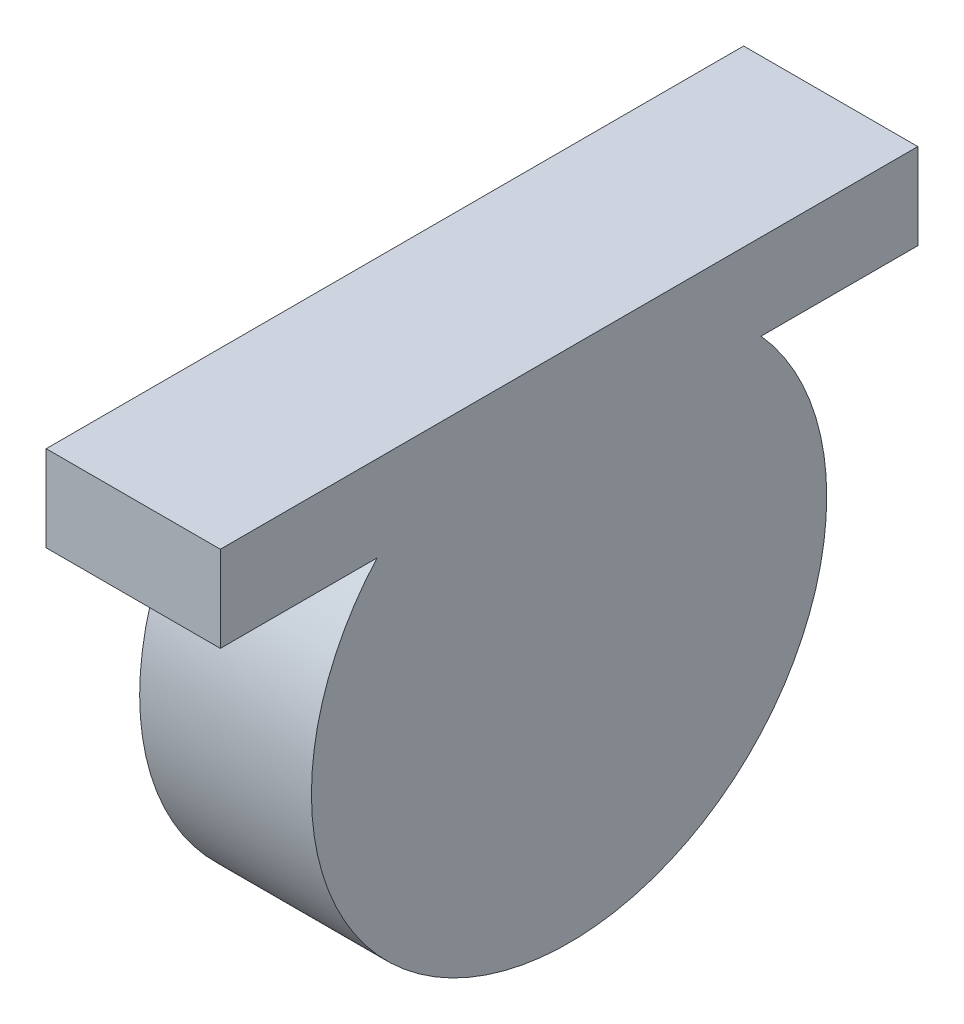
ISO-10303-21;
HEADER;
FILE_DESCRIPTION(('STEP AP214'),'2;1');
FILE_NAME('part.step','',(''),(''),'','','');
FILE_SCHEMA(('AUTOMOTIVE_DESIGN { 1 0 10303 214 1 1 1 1 }'));
ENDSEC;
DATA;
#1=APPLICATION_CONTEXT('core data for automotive mechanical design processes');
#2=APPLICATION_PROTOCOL_DEFINITION('international standard','automotive_design',2000,#1);
#3=PRODUCT_CONTEXT('',#1,'mechanical');
#4=PRODUCT('Part','Part','',(#3));
#5=PRODUCT_RELATED_PRODUCT_CATEGORY('part','',(#4));
#6=PRODUCT_DEFINITION_FORMATION('','',#4);
#7=PRODUCT_DEFINITION_CONTEXT('part definition',#1,'design');
#8=PRODUCT_DEFINITION('design','',#6,#7);
#9=PRODUCT_DEFINITION_SHAPE('','',#8);
#10=(LENGTH_UNIT() NAMED_UNIT(*) SI_UNIT(.MILLI.,.METRE.));
#11=(NAMED_UNIT(*) PLANE_ANGLE_UNIT() SI_UNIT($,.RADIAN.));
#12=(NAMED_UNIT(*) SI_UNIT($,.STERADIAN.) SOLID_ANGLE_UNIT());
#13=UNCERTAINTY_MEASURE_WITH_UNIT(LENGTH_MEASURE(1.E-05),#10,'distance_accuracy_value','');
#14=(GEOMETRIC_REPRESENTATION_CONTEXT(3) GLOBAL_UNCERTAINTY_ASSIGNED_CONTEXT((#13)) GLOBAL_UNIT_ASSIGNED_CONTEXT((#10,
#11,#12)) REPRESENTATION_CONTEXT('',''));
#15=CARTESIAN_POINT('',(0.,0.,0.));
#16=DIRECTION('',(0.,0.,1.));
#17=DIRECTION('',(1.,0.,0.));
#18=AXIS2_PLACEMENT_3D('',#15,#16,#17);
#19=CARTESIAN_POINT('',(524.151448501643,704.936591225599,712.116595063659));
#20=DIRECTION('',(-1.,0.,0.));
#21=DIRECTION('',(0.,0.,0.999999999999998));
#22=AXIS2_PLACEMENT_3D('',#19,#20,#21);
#23=PLANE('',#22);
#24=DIRECTION('',(0.,0.,0.999999999999998));
#25=VECTOR('',#24,1.);
#26=CARTESIAN_POINT('',(524.151448501643,717.636591225599,712.116595063659));
#27=LINE('',#26,#25);
#28=CARTESIAN_POINT('',(524.151448501643,717.636591225601,608.979235793006));
#29=VERTEX_POINT('',#28);
#30=CARTESIAN_POINT('',(524.151448501643,717.636591225599,712.116595063659));
#31=VERTEX_POINT('',#30);
#32=EDGE_CURVE('E100',#29,#31,#27,.T.);
#33=ORIENTED_EDGE('',*,*,#32,.T.);
#34=DIRECTION('',(0.,0.999999999999998,0.));
#35=VECTOR('',#34,1.);
#36=CARTESIAN_POINT('',(524.151448501643,704.936591225599,712.116595063659));
#37=LINE('',#36,#35);
#38=CARTESIAN_POINT('',(524.151448501643,704.936591225599,712.116595063659));
#39=VERTEX_POINT('',#38);
#40=EDGE_CURVE('E11',#39,#31,#37,.T.);
#41=ORIENTED_EDGE('',*,*,#40,.F.);
#42=DIRECTION('',(0.,0.,0.999999999999998));
#43=VECTOR('',#42,1.);
#44=CARTESIAN_POINT('',(524.151448501643,704.936591225599,712.116595063659));
#45=LINE('',#44,#43);
#46=CARTESIAN_POINT('',(524.151448501643,704.936591225596,688.94597874258));
#47=VERTEX_POINT('',#46);
#48=EDGE_CURVE('E87',#47,#39,#45,.T.);
#49=ORIENTED_EDGE('',*,*,#48,.F.);
#50=CARTESIAN_POINT('',(524.151448501643,679.536591225597,660.547915428331));
#51=DIRECTION('',(1.,0.,0.));
#52=DIRECTION('',(0.,0.,-0.999999999999998));
#53=AXIS2_PLACEMENT_3D('',#50,#51,#52);
#54=CIRCLE('',#53,38.1000000000001);
#55=CARTESIAN_POINT('',(524.151448501643,704.936591225598,632.149852114085));
#56=VERTEX_POINT('',#55);
#57=EDGE_CURVE('E90',#47,#56,#54,.T.);
#58=ORIENTED_EDGE('',*,*,#57,.T.);
#59=CARTESIAN_POINT('',(524.151448501643,704.936591225601,608.979235793006));
#60=VERTEX_POINT('',#59);
#61=EDGE_CURVE('E92',#60,#56,#45,.T.);
#62=ORIENTED_EDGE('',*,*,#61,.F.);
#63=DIRECTION('',(0.,0.999999999999998,0.));
#64=VECTOR('',#63,1.);
#65=CARTESIAN_POINT('',(524.151448501643,704.936591225601,608.979235793006));
#66=LINE('',#65,#64);
#67=EDGE_CURVE('E115',#60,#29,#66,.T.);
#68=ORIENTED_EDGE('',*,*,#67,.T.);
#69=EDGE_LOOP('',(#33,#41,#49,#58,#62,#68));
#70=FACE_BOUND('',#69,.T.);
#71=ADVANCED_FACE('F36',(#70),#23,.F.);
#72=CARTESIAN_POINT('',(524.151448501643,704.936591225599,712.116595063659));
#73=DIRECTION('',(0.,0.,-0.999999999999998));
#74=DIRECTION('',(0.,0.999999999999998,0.));
#75=AXIS2_PLACEMENT_3D('',#72,#73,#74);
#76=PLANE('',#75);
#77=DIRECTION('',(-1.,0.,0.));
#78=VECTOR('',#77,1.);
#79=CARTESIAN_POINT('',(524.151448501643,717.636591225599,712.116595063659));
#80=LINE('',#79,#78);
#81=CARTESIAN_POINT('',(498.398398097907,717.636591225599,712.116595063659));
#82=VERTEX_POINT('',#81);
#83=EDGE_CURVE('E117',#31,#82,#80,.T.);
#84=ORIENTED_EDGE('',*,*,#83,.T.);
#85=DIRECTION('',(0.,0.999999999999998,0.));
#86=VECTOR('',#85,1.);
#87=CARTESIAN_POINT('',(498.398398097907,704.936591225599,712.116595063659));
#88=LINE('',#87,#86);
#89=CARTESIAN_POINT('',(498.398398097907,704.936591225599,712.116595063659));
#90=VERTEX_POINT('',#89);
#91=EDGE_CURVE('E43',#90,#82,#88,.T.);
#92=ORIENTED_EDGE('',*,*,#91,.F.);
#93=DIRECTION('',(-1.,0.,0.));
#94=VECTOR('',#93,1.);
#95=CARTESIAN_POINT('',(524.151448501643,704.936591225599,712.116595063659));
#96=LINE('',#95,#94);
#97=EDGE_CURVE('E109',#39,#90,#96,.T.);
#98=ORIENTED_EDGE('',*,*,#97,.F.);
#99=ORIENTED_EDGE('',*,*,#40,.T.);
#100=EDGE_LOOP('',(#84,#92,#98,#99));
#101=FACE_BOUND('',#100,.T.);
#102=ADVANCED_FACE('F143',(#101),#76,.F.);
#103=CARTESIAN_POINT('',(498.398398097907,704.936591225599,712.116595063659));
#104=DIRECTION('',(1.,0.,0.));
#105=DIRECTION('',(0.,0.,-0.999999999999998));
#106=AXIS2_PLACEMENT_3D('',#103,#104,#105);
#107=PLANE('',#106);
#108=DIRECTION('',(0.,0.,-0.999999999999998));
#109=VECTOR('',#108,1.);
#110=CARTESIAN_POINT('',(498.398398097907,717.636591225599,712.116595063659));
#111=LINE('',#110,#109);
#112=CARTESIAN_POINT('',(498.398398097907,717.636591225601,608.979235793006));
#113=VERTEX_POINT('',#112);
#114=EDGE_CURVE('E119',#82,#113,#111,.T.);
#115=ORIENTED_EDGE('',*,*,#114,.T.);
#116=DIRECTION('',(0.,0.999999999999998,0.));
#117=VECTOR('',#116,1.);
#118=CARTESIAN_POINT('',(498.398398097907,704.936591225601,608.979235793006));
#119=LINE('',#118,#117);
#120=CARTESIAN_POINT('',(498.398398097907,704.936591225601,608.979235793006));
#121=VERTEX_POINT('',#120);
#122=EDGE_CURVE('E124',#121,#113,#119,.T.);
#123=ORIENTED_EDGE('',*,*,#122,.F.);
#124=DIRECTION('',(0.,0.,-0.999999999999998));
#125=VECTOR('',#124,1.);
#126=CARTESIAN_POINT('',(498.398398097907,704.936591225599,712.116595063659));
#127=LINE('',#126,#125);
#128=EDGE_CURVE('E111',#90,#121,#127,.T.);
#129=ORIENTED_EDGE('',*,*,#128,.F.);
#130=ORIENTED_EDGE('',*,*,#91,.T.);
#131=EDGE_LOOP('',(#115,#123,#129,#130));
#132=FACE_BOUND('',#131,.T.);
#133=ADVANCED_FACE('F131',(#132),#107,.F.);
#134=CARTESIAN_POINT('',(524.151448501643,704.936591225601,608.979235793006));
#135=DIRECTION('',(0.,0.,0.999999999999998));
#136=DIRECTION('',(0.,-0.999999999999998,0.));
#137=AXIS2_PLACEMENT_3D('',#134,#135,#136);
#138=PLANE('',#137);
#139=DIRECTION('',(1.,0.,0.));
#140=VECTOR('',#139,1.);
#141=CARTESIAN_POINT('',(524.151448501643,717.636591225601,608.979235793006));
#142=LINE('',#141,#140);
#143=EDGE_CURVE('E93',#113,#29,#142,.T.);
#144=ORIENTED_EDGE('',*,*,#143,.T.);
#145=ORIENTED_EDGE('',*,*,#67,.F.);
#146=DIRECTION('',(1.,0.,0.));
#147=VECTOR('',#146,1.);
#148=CARTESIAN_POINT('',(524.151448501643,704.936591225601,608.979235793006));
#149=LINE('',#148,#147);
#150=EDGE_CURVE('E113',#121,#60,#149,.T.);
#151=ORIENTED_EDGE('',*,*,#150,.F.);
#152=ORIENTED_EDGE('',*,*,#122,.T.);
#153=EDGE_LOOP('',(#144,#145,#151,#152));
#154=FACE_BOUND('',#153,.T.);
#155=ADVANCED_FACE('F141',(#154),#138,.F.);
#156=CARTESIAN_POINT('',(0.,704.936591225595,-1.77635683940025E-12));
#157=DIRECTION('',(0.,0.999999999999998,0.));
#158=DIRECTION('',(0.,0.,0.999999999999998));
#159=AXIS2_PLACEMENT_3D('',#156,#157,#158);
#160=PLANE('',#159);
#161=DIRECTION('',(0.,0.,-0.999999999999998));
#162=VECTOR('',#161,1.);
#163=CARTESIAN_POINT('',(498.751448501642,704.936591225595,-1.77635683940025E-12));
#164=LINE('',#163,#162);
#165=CARTESIAN_POINT('',(498.751448501642,704.936591225596,688.94597874258));
#166=VERTEX_POINT('',#165);
#167=CARTESIAN_POINT('',(498.751448501642,704.936591225598,632.149852114085));
#168=VERTEX_POINT('',#167);
#169=EDGE_CURVE('E54',#166,#168,#164,.T.);
#170=ORIENTED_EDGE('',*,*,#169,.F.);
#171=DIRECTION('',(1.,0.,0.));
#172=VECTOR('',#171,1.);
#173=CARTESIAN_POINT('',(498.751448501642,704.936591225596,688.94597874258));
#174=LINE('',#173,#172);
#175=EDGE_CURVE('E95',#166,#47,#174,.T.);
#176=ORIENTED_EDGE('',*,*,#175,.T.);
#177=ORIENTED_EDGE('',*,*,#48,.T.);
#178=ORIENTED_EDGE('',*,*,#97,.T.);
#179=ORIENTED_EDGE('',*,*,#128,.T.);
#180=ORIENTED_EDGE('',*,*,#150,.T.);
#181=ORIENTED_EDGE('',*,*,#61,.T.);
#182=DIRECTION('',(1.,0.,0.));
#183=VECTOR('',#182,1.);
#184=CARTESIAN_POINT('',(498.751448501642,704.936591225598,632.149852114085));
#185=LINE('',#184,#183);
#186=EDGE_CURVE('E50',#56,#168,#185,.F.);
#187=ORIENTED_EDGE('',*,*,#186,.T.);
#188=EDGE_LOOP('',(#170,#176,#177,#178,#179,#180,#181,#187));
#189=FACE_BOUND('',#188,.T.);
#190=ADVANCED_FACE('F96',(#189),#160,.F.);
#191=CARTESIAN_POINT('',(0.,717.636591225595,-1.77635683940025E-12));
#192=DIRECTION('',(0.,0.999999999999998,0.));
#193=DIRECTION('',(0.,0.,0.999999999999998));
#194=AXIS2_PLACEMENT_3D('',#191,#192,#193);
#195=PLANE('',#194);
#196=ORIENTED_EDGE('',*,*,#83,.F.);
#197=ORIENTED_EDGE('',*,*,#32,.F.);
#198=ORIENTED_EDGE('',*,*,#143,.F.);
#199=ORIENTED_EDGE('',*,*,#114,.F.);
#200=EDGE_LOOP('',(#196,#197,#198,#199));
#201=FACE_BOUND('',#200,.T.);
#202=ADVANCED_FACE('F137',(#201),#195,.T.);
#203=CARTESIAN_POINT('',(498.751448501642,679.536591225597,660.547915428331));
#204=DIRECTION('',(1.,0.,0.));
#205=DIRECTION('',(0.,0.,-0.999999999999998));
#206=AXIS2_PLACEMENT_3D('',#203,#204,#205);
#207=CYLINDRICAL_SURFACE('',#206,38.1000000000001);
#208=ORIENTED_EDGE('',*,*,#175,.F.);
#209=CARTESIAN_POINT('',(498.751448501642,679.536591225597,660.547915428331));
#210=DIRECTION('',(1.,0.,0.));
#211=DIRECTION('',(0.,0.,-0.999999999999998));
#212=AXIS2_PLACEMENT_3D('',#209,#210,#211);
#213=CIRCLE('',#212,38.1000000000001);
#214=EDGE_CURVE('E103',#166,#168,#213,.T.);
#215=ORIENTED_EDGE('',*,*,#214,.T.);
#216=ORIENTED_EDGE('',*,*,#186,.F.);
#217=ORIENTED_EDGE('',*,*,#57,.F.);
#218=EDGE_LOOP('',(#208,#215,#216,#217));
#219=FACE_BOUND('',#218,.T.);
#220=ADVANCED_FACE('F102',(#219),#207,.T.);
#221=CARTESIAN_POINT('',(498.751448501642,679.536591225597,660.547915428331));
#222=DIRECTION('',(1.,0.,0.));
#223=DIRECTION('',(0.,0.,-0.999999999999998));
#224=AXIS2_PLACEMENT_3D('',#221,#222,#223);
#225=PLANE('',#224);
#226=ORIENTED_EDGE('',*,*,#214,.F.);
#227=ORIENTED_EDGE('',*,*,#169,.T.);
#228=EDGE_LOOP('',(#226,#227));
#229=FACE_BOUND('',#228,.T.);
#230=ADVANCED_FACE('F159',(#229),#225,.F.);
#231=CLOSED_SHELL('',(#71,#102,#133,#155,#190,#202,#220,#230));
#232=MANIFOLD_SOLID_BREP('B2',#231);
#233=ADVANCED_BREP_SHAPE_REPRESENTATION('',(#18,#232),#14);
#234=SHAPE_DEFINITION_REPRESENTATION(#9,#233);
ENDSEC;
END-ISO-10303-21;
